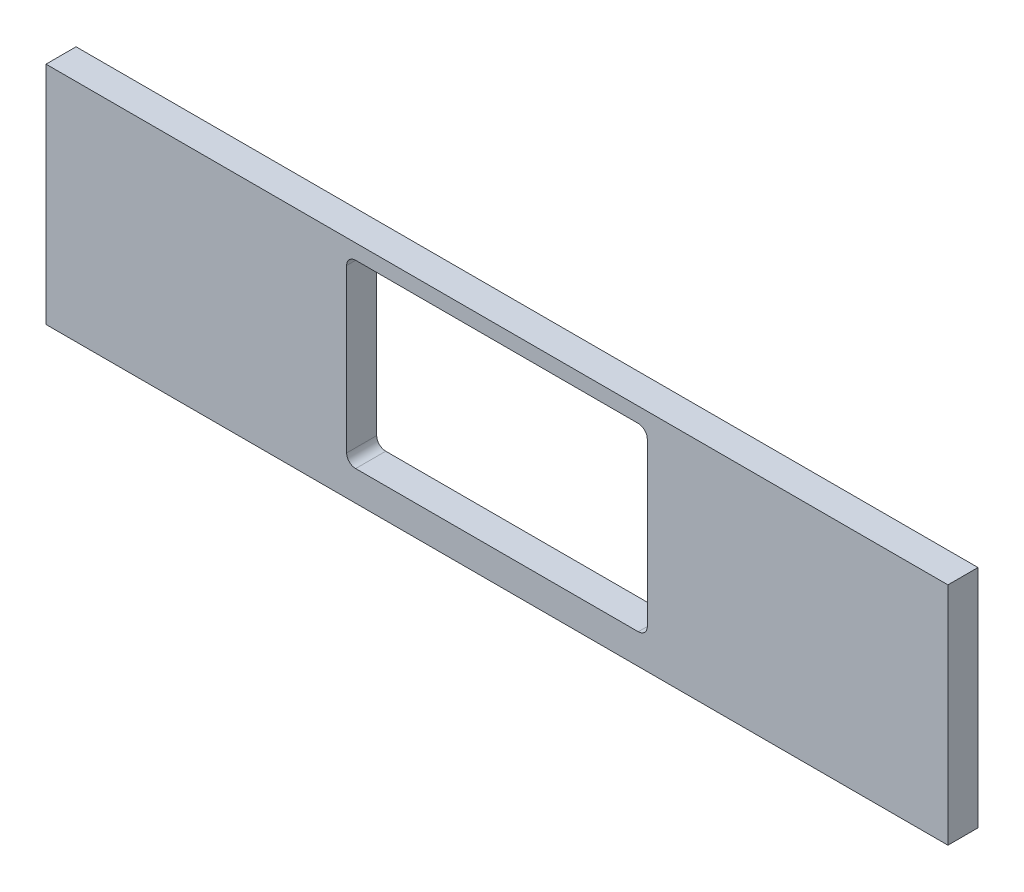
ISO-10303-21;
HEADER;
FILE_DESCRIPTION(('STEP AP214'),'2;1');
FILE_NAME('part.step','',(''),(''),'','','');
FILE_SCHEMA(('AUTOMOTIVE_DESIGN { 1 0 10303 214 1 1 1 1 }'));
ENDSEC;
DATA;
#1=APPLICATION_CONTEXT('core data for automotive mechanical design processes');
#2=APPLICATION_PROTOCOL_DEFINITION('international standard','automotive_design',2000,#1);
#3=PRODUCT_CONTEXT('',#1,'mechanical');
#4=PRODUCT('Part','Part','',(#3));
#5=PRODUCT_RELATED_PRODUCT_CATEGORY('part','',(#4));
#6=PRODUCT_DEFINITION_FORMATION('','',#4);
#7=PRODUCT_DEFINITION_CONTEXT('part definition',#1,'design');
#8=PRODUCT_DEFINITION('design','',#6,#7);
#9=PRODUCT_DEFINITION_SHAPE('','',#8);
#10=(LENGTH_UNIT() NAMED_UNIT(*) SI_UNIT(.MILLI.,.METRE.));
#11=(NAMED_UNIT(*) PLANE_ANGLE_UNIT() SI_UNIT($,.RADIAN.));
#12=(NAMED_UNIT(*) SI_UNIT($,.STERADIAN.) SOLID_ANGLE_UNIT());
#13=UNCERTAINTY_MEASURE_WITH_UNIT(LENGTH_MEASURE(1.E-05),#10,'distance_accuracy_value','');
#14=(GEOMETRIC_REPRESENTATION_CONTEXT(3) GLOBAL_UNCERTAINTY_ASSIGNED_CONTEXT((#13)) GLOBAL_UNIT_ASSIGNED_CONTEXT((#10,
#11,#12)) REPRESENTATION_CONTEXT('',''));
#15=CARTESIAN_POINT('',(0.,0.,0.));
#16=DIRECTION('',(0.,0.,1.));
#17=DIRECTION('',(1.,0.,0.));
#18=AXIS2_PLACEMENT_3D('',#15,#16,#17);
#19=CARTESIAN_POINT('',(150.,-150.,10.));
#20=DIRECTION('',(-1.,0.,0.));
#21=DIRECTION('',(0.,0.,1.));
#22=AXIS2_PLACEMENT_3D('',#19,#20,#21);
#23=PLANE('',#22);
#24=DIRECTION('',(0.,1.,0.));
#25=VECTOR('',#24,1.);
#26=CARTESIAN_POINT('',(150.,-150.,0.));
#27=LINE('',#26,#25);
#28=CARTESIAN_POINT('',(150.,-150.,0.));
#29=VERTEX_POINT('',#28);
#30=CARTESIAN_POINT('',(150.,-75.,0.));
#31=VERTEX_POINT('',#30);
#32=EDGE_CURVE('E143',#29,#31,#27,.T.);
#33=ORIENTED_EDGE('',*,*,#32,.T.);
#34=DIRECTION('',(0.,0.,-1.));
#35=VECTOR('',#34,1.);
#36=CARTESIAN_POINT('',(150.,-75.,10.));
#37=LINE('',#36,#35);
#38=CARTESIAN_POINT('',(150.,-75.,10.));
#39=VERTEX_POINT('',#38);
#40=EDGE_CURVE('E124',#39,#31,#37,.T.);
#41=ORIENTED_EDGE('',*,*,#40,.F.);
#42=DIRECTION('',(0.,1.,0.));
#43=VECTOR('',#42,1.);
#44=CARTESIAN_POINT('',(150.,-150.,10.));
#45=LINE('',#44,#43);
#46=CARTESIAN_POINT('',(150.,-150.,10.));
#47=VERTEX_POINT('',#46);
#48=EDGE_CURVE('E131',#47,#39,#45,.T.);
#49=ORIENTED_EDGE('',*,*,#48,.F.);
#50=DIRECTION('',(0.,0.,-1.));
#51=VECTOR('',#50,1.);
#52=CARTESIAN_POINT('',(150.,-150.,10.));
#53=LINE('',#52,#51);
#54=EDGE_CURVE('E215',#47,#29,#53,.T.);
#55=ORIENTED_EDGE('',*,*,#54,.T.);
#56=EDGE_LOOP('',(#33,#41,#49,#55));
#57=FACE_BOUND('',#56,.T.);
#58=ADVANCED_FACE('F31',(#57),#23,.F.);
#59=CARTESIAN_POINT('',(150.,-75.,10.));
#60=DIRECTION('',(0.,-1.,0.));
#61=DIRECTION('',(1.,0.,0.));
#62=AXIS2_PLACEMENT_3D('',#59,#60,#61);
#63=PLANE('',#62);
#64=DIRECTION('',(-1.,0.,0.));
#65=VECTOR('',#64,1.);
#66=CARTESIAN_POINT('',(150.,-75.,0.));
#67=LINE('',#66,#65);
#68=CARTESIAN_POINT('',(-150.,-75.,0.));
#69=VERTEX_POINT('',#68);
#70=EDGE_CURVE('E217',#31,#69,#67,.T.);
#71=ORIENTED_EDGE('',*,*,#70,.T.);
#72=DIRECTION('',(0.,0.,-1.));
#73=VECTOR('',#72,1.);
#74=CARTESIAN_POINT('',(-150.,-75.,10.));
#75=LINE('',#74,#73);
#76=CARTESIAN_POINT('',(-150.,-75.,10.));
#77=VERTEX_POINT('',#76);
#78=EDGE_CURVE('E127',#77,#69,#75,.T.);
#79=ORIENTED_EDGE('',*,*,#78,.F.);
#80=DIRECTION('',(-1.,0.,0.));
#81=VECTOR('',#80,1.);
#82=CARTESIAN_POINT('',(150.,-75.,10.));
#83=LINE('',#82,#81);
#84=EDGE_CURVE('E120',#39,#77,#83,.T.);
#85=ORIENTED_EDGE('',*,*,#84,.F.);
#86=ORIENTED_EDGE('',*,*,#40,.T.);
#87=EDGE_LOOP('',(#71,#79,#85,#86));
#88=FACE_BOUND('',#87,.T.);
#89=ADVANCED_FACE('F122',(#88),#63,.F.);
#90=CARTESIAN_POINT('',(-150.,-150.,10.));
#91=DIRECTION('',(1.,0.,0.));
#92=DIRECTION('',(0.,0.,-1.));
#93=AXIS2_PLACEMENT_3D('',#90,#91,#92);
#94=PLANE('',#93);
#95=DIRECTION('',(0.,-1.,0.));
#96=VECTOR('',#95,1.);
#97=CARTESIAN_POINT('',(-150.,-150.,0.));
#98=LINE('',#97,#96);
#99=CARTESIAN_POINT('',(-150.,-150.,0.));
#100=VERTEX_POINT('',#99);
#101=EDGE_CURVE('E219',#69,#100,#98,.T.);
#102=ORIENTED_EDGE('',*,*,#101,.T.);
#103=DIRECTION('',(0.,0.,-1.));
#104=VECTOR('',#103,1.);
#105=CARTESIAN_POINT('',(-150.,-150.,10.));
#106=LINE('',#105,#104);
#107=CARTESIAN_POINT('',(-150.,-150.,10.));
#108=VERTEX_POINT('',#107);
#109=EDGE_CURVE('E148',#108,#100,#106,.T.);
#110=ORIENTED_EDGE('',*,*,#109,.F.);
#111=DIRECTION('',(0.,-1.,0.));
#112=VECTOR('',#111,1.);
#113=CARTESIAN_POINT('',(-150.,-150.,10.));
#114=LINE('',#113,#112);
#115=EDGE_CURVE('E130',#77,#108,#114,.T.);
#116=ORIENTED_EDGE('',*,*,#115,.F.);
#117=ORIENTED_EDGE('',*,*,#78,.T.);
#118=EDGE_LOOP('',(#102,#110,#116,#117));
#119=FACE_BOUND('',#118,.T.);
#120=ADVANCED_FACE('F231',(#119),#94,.F.);
#121=CARTESIAN_POINT('',(150.,-150.,10.));
#122=DIRECTION('',(0.,1.,0.));
#123=DIRECTION('',(-1.,0.,0.));
#124=AXIS2_PLACEMENT_3D('',#121,#122,#123);
#125=PLANE('',#124);
#126=DIRECTION('',(1.,0.,0.));
#127=VECTOR('',#126,1.);
#128=CARTESIAN_POINT('',(150.,-150.,0.));
#129=LINE('',#128,#127);
#130=EDGE_CURVE('E140',#100,#29,#129,.T.);
#131=ORIENTED_EDGE('',*,*,#130,.T.);
#132=ORIENTED_EDGE('',*,*,#54,.F.);
#133=DIRECTION('',(1.,0.,0.));
#134=VECTOR('',#133,1.);
#135=CARTESIAN_POINT('',(150.,-150.,10.));
#136=LINE('',#135,#134);
#137=EDGE_CURVE('E136',#108,#47,#136,.T.);
#138=ORIENTED_EDGE('',*,*,#137,.F.);
#139=ORIENTED_EDGE('',*,*,#109,.T.);
#140=EDGE_LOOP('',(#131,#132,#138,#139));
#141=FACE_BOUND('',#140,.T.);
#142=ADVANCED_FACE('F226',(#141),#125,.F.);
#143=CARTESIAN_POINT('',(150.,-75.,10.));
#144=DIRECTION('',(0.,0.,1.));
#145=DIRECTION('',(1.,0.,0.));
#146=AXIS2_PLACEMENT_3D('',#143,#144,#145);
#147=PLANE('',#146);
#148=DIRECTION('',(0.,1.,0.));
#149=VECTOR('',#148,1.);
#150=CARTESIAN_POINT('',(50.,-140.,10.));
#151=LINE('',#150,#149);
#152=CARTESIAN_POINT('',(50.,-137.,10.));
#153=VERTEX_POINT('',#152);
#154=CARTESIAN_POINT('',(50.,-83.,10.));
#155=VERTEX_POINT('',#154);
#156=EDGE_CURVE('E183',#153,#155,#151,.T.);
#157=ORIENTED_EDGE('',*,*,#156,.F.);
#158=CARTESIAN_POINT('',(47.,-137.,10.));
#159=DIRECTION('',(0.,0.,1.));
#160=DIRECTION('',(1.,0.,0.));
#161=AXIS2_PLACEMENT_3D('',#158,#159,#160);
#162=CIRCLE('',#161,3.);
#163=CARTESIAN_POINT('',(47.,-140.,10.));
#164=VERTEX_POINT('',#163);
#165=EDGE_CURVE('E172',#153,#164,#162,.F.);
#166=ORIENTED_EDGE('',*,*,#165,.T.);
#167=DIRECTION('',(1.,0.,0.));
#168=VECTOR('',#167,1.);
#169=CARTESIAN_POINT('',(50.,-140.,10.));
#170=LINE('',#169,#168);
#171=CARTESIAN_POINT('',(-47.,-140.,10.));
#172=VERTEX_POINT('',#171);
#173=EDGE_CURVE('E202',#172,#164,#170,.T.);
#174=ORIENTED_EDGE('',*,*,#173,.F.);
#175=CARTESIAN_POINT('',(-47.,-137.,10.));
#176=DIRECTION('',(0.,0.,1.));
#177=DIRECTION('',(1.,0.,0.));
#178=AXIS2_PLACEMENT_3D('',#175,#176,#177);
#179=CIRCLE('',#178,3.);
#180=CARTESIAN_POINT('',(-50.,-137.,10.));
#181=VERTEX_POINT('',#180);
#182=EDGE_CURVE('E168',#172,#181,#179,.F.);
#183=ORIENTED_EDGE('',*,*,#182,.T.);
#184=DIRECTION('',(0.,-1.,0.));
#185=VECTOR('',#184,1.);
#186=CARTESIAN_POINT('',(-50.,-140.,10.));
#187=LINE('',#186,#185);
#188=CARTESIAN_POINT('',(-50.,-83.,10.));
#189=VERTEX_POINT('',#188);
#190=EDGE_CURVE('E208',#189,#181,#187,.T.);
#191=ORIENTED_EDGE('',*,*,#190,.F.);
#192=CARTESIAN_POINT('',(-47.,-83.,10.));
#193=DIRECTION('',(0.,0.,1.));
#194=DIRECTION('',(1.,0.,0.));
#195=AXIS2_PLACEMENT_3D('',#192,#193,#194);
#196=CIRCLE('',#195,3.);
#197=CARTESIAN_POINT('',(-47.,-80.,10.));
#198=VERTEX_POINT('',#197);
#199=EDGE_CURVE('E176',#189,#198,#196,.F.);
#200=ORIENTED_EDGE('',*,*,#199,.T.);
#201=DIRECTION('',(-1.,0.,0.));
#202=VECTOR('',#201,1.);
#203=CARTESIAN_POINT('',(50.,-80.,10.));
#204=LINE('',#203,#202);
#205=CARTESIAN_POINT('',(47.,-80.,10.));
#206=VERTEX_POINT('',#205);
#207=EDGE_CURVE('E184',#206,#198,#204,.T.);
#208=ORIENTED_EDGE('',*,*,#207,.F.);
#209=CARTESIAN_POINT('',(47.,-83.,10.));
#210=DIRECTION('',(0.,0.,1.));
#211=DIRECTION('',(1.,0.,0.));
#212=AXIS2_PLACEMENT_3D('',#209,#210,#211);
#213=CIRCLE('',#212,3.);
#214=EDGE_CURVE('E39',#206,#155,#213,.F.);
#215=ORIENTED_EDGE('',*,*,#214,.T.);
#216=EDGE_LOOP('',(#157,#166,#174,#183,#191,#200,#208,#215));
#217=FACE_BOUND('',#216,.T.);
#218=ORIENTED_EDGE('',*,*,#48,.T.);
#219=ORIENTED_EDGE('',*,*,#84,.T.);
#220=ORIENTED_EDGE('',*,*,#115,.T.);
#221=ORIENTED_EDGE('',*,*,#137,.T.);
#222=EDGE_LOOP('',(#218,#219,#220,#221));
#223=FACE_BOUND('',#222,.T.);
#224=ADVANCED_FACE('F134',(#217,#223),#147,.T.);
#225=CARTESIAN_POINT('',(150.,-75.,0.));
#226=DIRECTION('',(0.,0.,1.));
#227=DIRECTION('',(1.,0.,0.));
#228=AXIS2_PLACEMENT_3D('',#225,#226,#227);
#229=PLANE('',#228);
#230=DIRECTION('',(0.,-1.,0.));
#231=VECTOR('',#230,1.);
#232=CARTESIAN_POINT('',(-50.,-140.,0.));
#233=LINE('',#232,#231);
#234=CARTESIAN_POINT('',(-50.,-83.,0.));
#235=VERTEX_POINT('',#234);
#236=CARTESIAN_POINT('',(-50.,-137.,0.));
#237=VERTEX_POINT('',#236);
#238=EDGE_CURVE('E196',#235,#237,#233,.T.);
#239=ORIENTED_EDGE('',*,*,#238,.T.);
#240=CARTESIAN_POINT('',(-47.,-137.,0.));
#241=DIRECTION('',(0.,0.,1.));
#242=DIRECTION('',(1.,0.,0.));
#243=AXIS2_PLACEMENT_3D('',#240,#241,#242);
#244=CIRCLE('',#243,3.);
#245=CARTESIAN_POINT('',(-47.,-140.,0.));
#246=VERTEX_POINT('',#245);
#247=EDGE_CURVE('E170',#237,#246,#244,.T.);
#248=ORIENTED_EDGE('',*,*,#247,.T.);
#249=DIRECTION('',(1.,0.,0.));
#250=VECTOR('',#249,1.);
#251=CARTESIAN_POINT('',(50.,-140.,0.));
#252=LINE('',#251,#250);
#253=CARTESIAN_POINT('',(47.,-140.,0.));
#254=VERTEX_POINT('',#253);
#255=EDGE_CURVE('E200',#246,#254,#252,.T.);
#256=ORIENTED_EDGE('',*,*,#255,.T.);
#257=CARTESIAN_POINT('',(47.,-137.,0.));
#258=DIRECTION('',(0.,0.,1.));
#259=DIRECTION('',(1.,0.,0.));
#260=AXIS2_PLACEMENT_3D('',#257,#258,#259);
#261=CIRCLE('',#260,3.);
#262=CARTESIAN_POINT('',(50.,-137.,0.));
#263=VERTEX_POINT('',#262);
#264=EDGE_CURVE('E174',#254,#263,#261,.T.);
#265=ORIENTED_EDGE('',*,*,#264,.T.);
#266=DIRECTION('',(0.,1.,0.));
#267=VECTOR('',#266,1.);
#268=CARTESIAN_POINT('',(50.,-140.,0.));
#269=LINE('',#268,#267);
#270=CARTESIAN_POINT('',(50.,-83.,0.));
#271=VERTEX_POINT('',#270);
#272=EDGE_CURVE('E197',#263,#271,#269,.T.);
#273=ORIENTED_EDGE('',*,*,#272,.T.);
#274=CARTESIAN_POINT('',(47.,-83.,0.));
#275=DIRECTION('',(0.,0.,1.));
#276=DIRECTION('',(1.,0.,0.));
#277=AXIS2_PLACEMENT_3D('',#274,#275,#276);
#278=CIRCLE('',#277,3.);
#279=CARTESIAN_POINT('',(47.,-80.,0.));
#280=VERTEX_POINT('',#279);
#281=EDGE_CURVE('E11',#271,#280,#278,.T.);
#282=ORIENTED_EDGE('',*,*,#281,.T.);
#283=DIRECTION('',(-1.,0.,0.));
#284=VECTOR('',#283,1.);
#285=CARTESIAN_POINT('',(50.,-80.,0.));
#286=LINE('',#285,#284);
#287=CARTESIAN_POINT('',(-47.,-80.,0.));
#288=VERTEX_POINT('',#287);
#289=EDGE_CURVE('E194',#280,#288,#286,.T.);
#290=ORIENTED_EDGE('',*,*,#289,.T.);
#291=CARTESIAN_POINT('',(-47.,-83.,0.));
#292=DIRECTION('',(0.,0.,1.));
#293=DIRECTION('',(1.,0.,0.));
#294=AXIS2_PLACEMENT_3D('',#291,#292,#293);
#295=CIRCLE('',#294,3.);
#296=EDGE_CURVE('E178',#288,#235,#295,.T.);
#297=ORIENTED_EDGE('',*,*,#296,.T.);
#298=EDGE_LOOP('',(#239,#248,#256,#265,#273,#282,#290,#297));
#299=FACE_BOUND('',#298,.T.);
#300=ORIENTED_EDGE('',*,*,#32,.F.);
#301=ORIENTED_EDGE('',*,*,#130,.F.);
#302=ORIENTED_EDGE('',*,*,#101,.F.);
#303=ORIENTED_EDGE('',*,*,#70,.F.);
#304=EDGE_LOOP('',(#300,#301,#302,#303));
#305=FACE_BOUND('',#304,.T.);
#306=ADVANCED_FACE('F230',(#299,#305),#229,.F.);
#307=CARTESIAN_POINT('',(50.,-140.,0.));
#308=DIRECTION('',(1.,0.,0.));
#309=DIRECTION('',(0.,0.,-1.));
#310=AXIS2_PLACEMENT_3D('',#307,#308,#309);
#311=PLANE('',#310);
#312=ORIENTED_EDGE('',*,*,#272,.F.);
#313=DIRECTION('',(0.,0.,1.));
#314=VECTOR('',#313,1.);
#315=CARTESIAN_POINT('',(50.,-137.,10.));
#316=LINE('',#315,#314);
#317=EDGE_CURVE('E161',#263,#153,#316,.T.);
#318=ORIENTED_EDGE('',*,*,#317,.T.);
#319=ORIENTED_EDGE('',*,*,#156,.T.);
#320=DIRECTION('',(0.,0.,1.));
#321=VECTOR('',#320,1.);
#322=CARTESIAN_POINT('',(50.,-83.,0.));
#323=LINE('',#322,#321);
#324=EDGE_CURVE('E159',#155,#271,#323,.F.);
#325=ORIENTED_EDGE('',*,*,#324,.T.);
#326=EDGE_LOOP('',(#312,#318,#319,#325));
#327=FACE_BOUND('',#326,.T.);
#328=ADVANCED_FACE('F190',(#327),#311,.F.);
#329=CARTESIAN_POINT('',(50.,-140.,0.));
#330=DIRECTION('',(0.,-1.,0.));
#331=DIRECTION('',(0.,0.,-1.));
#332=AXIS2_PLACEMENT_3D('',#329,#330,#331);
#333=PLANE('',#332);
#334=ORIENTED_EDGE('',*,*,#255,.F.);
#335=DIRECTION('',(0.,0.,1.));
#336=VECTOR('',#335,1.);
#337=CARTESIAN_POINT('',(-47.,-140.,10.));
#338=LINE('',#337,#336);
#339=EDGE_CURVE('E146',#246,#172,#338,.T.);
#340=ORIENTED_EDGE('',*,*,#339,.T.);
#341=ORIENTED_EDGE('',*,*,#173,.T.);
#342=DIRECTION('',(0.,0.,1.));
#343=VECTOR('',#342,1.);
#344=CARTESIAN_POINT('',(47.,-140.,0.));
#345=LINE('',#344,#343);
#346=EDGE_CURVE('E144',#164,#254,#345,.F.);
#347=ORIENTED_EDGE('',*,*,#346,.T.);
#348=EDGE_LOOP('',(#334,#340,#341,#347));
#349=FACE_BOUND('',#348,.T.);
#350=ADVANCED_FACE('F269',(#349),#333,.F.);
#351=CARTESIAN_POINT('',(-50.,-140.,0.));
#352=DIRECTION('',(-1.,0.,0.));
#353=DIRECTION('',(0.,0.,1.));
#354=AXIS2_PLACEMENT_3D('',#351,#352,#353);
#355=PLANE('',#354);
#356=ORIENTED_EDGE('',*,*,#190,.T.);
#357=DIRECTION('',(0.,0.,1.));
#358=VECTOR('',#357,1.);
#359=CARTESIAN_POINT('',(-50.,-137.,0.));
#360=LINE('',#359,#358);
#361=EDGE_CURVE('E157',#181,#237,#360,.F.);
#362=ORIENTED_EDGE('',*,*,#361,.T.);
#363=ORIENTED_EDGE('',*,*,#238,.F.);
#364=DIRECTION('',(0.,0.,1.));
#365=VECTOR('',#364,1.);
#366=CARTESIAN_POINT('',(-50.,-83.,10.));
#367=LINE('',#366,#365);
#368=EDGE_CURVE('E154',#235,#189,#367,.T.);
#369=ORIENTED_EDGE('',*,*,#368,.T.);
#370=EDGE_LOOP('',(#356,#362,#363,#369));
#371=FACE_BOUND('',#370,.T.);
#372=ADVANCED_FACE('F262',(#371),#355,.F.);
#373=CARTESIAN_POINT('',(50.,-80.,0.));
#374=DIRECTION('',(0.,1.,0.));
#375=DIRECTION('',(-1.,0.,0.));
#376=AXIS2_PLACEMENT_3D('',#373,#374,#375);
#377=PLANE('',#376);
#378=ORIENTED_EDGE('',*,*,#207,.T.);
#379=DIRECTION('',(0.,0.,1.));
#380=VECTOR('',#379,1.);
#381=CARTESIAN_POINT('',(-47.,-80.,0.));
#382=LINE('',#381,#380);
#383=EDGE_CURVE('E46',#198,#288,#382,.F.);
#384=ORIENTED_EDGE('',*,*,#383,.T.);
#385=ORIENTED_EDGE('',*,*,#289,.F.);
#386=DIRECTION('',(0.,0.,1.));
#387=VECTOR('',#386,1.);
#388=CARTESIAN_POINT('',(47.,-80.,10.));
#389=LINE('',#388,#387);
#390=EDGE_CURVE('E164',#280,#206,#389,.T.);
#391=ORIENTED_EDGE('',*,*,#390,.T.);
#392=EDGE_LOOP('',(#378,#384,#385,#391));
#393=FACE_BOUND('',#392,.T.);
#394=ADVANCED_FACE('F193',(#393),#377,.F.);
#395=CARTESIAN_POINT('',(-47.,-137.,0.));
#396=DIRECTION('',(0.,0.,-1.));
#397=DIRECTION('',(-1.,0.,0.));
#398=AXIS2_PLACEMENT_3D('',#395,#396,#397);
#399=CYLINDRICAL_SURFACE('',#398,3.);
#400=ORIENTED_EDGE('',*,*,#247,.F.);
#401=ORIENTED_EDGE('',*,*,#361,.F.);
#402=ORIENTED_EDGE('',*,*,#182,.F.);
#403=ORIENTED_EDGE('',*,*,#339,.F.);
#404=EDGE_LOOP('',(#400,#401,#402,#403));
#405=FACE_BOUND('',#404,.T.);
#406=ADVANCED_FACE('F245',(#405),#399,.F.);
#407=CARTESIAN_POINT('',(47.,-137.,0.));
#408=DIRECTION('',(0.,0.,-1.));
#409=DIRECTION('',(-1.,0.,0.));
#410=AXIS2_PLACEMENT_3D('',#407,#408,#409);
#411=CYLINDRICAL_SURFACE('',#410,3.);
#412=ORIENTED_EDGE('',*,*,#264,.F.);
#413=ORIENTED_EDGE('',*,*,#346,.F.);
#414=ORIENTED_EDGE('',*,*,#165,.F.);
#415=ORIENTED_EDGE('',*,*,#317,.F.);
#416=EDGE_LOOP('',(#412,#413,#414,#415));
#417=FACE_BOUND('',#416,.T.);
#418=ADVANCED_FACE('F248',(#417),#411,.F.);
#419=CARTESIAN_POINT('',(-47.,-83.,0.));
#420=DIRECTION('',(0.,0.,-1.));
#421=DIRECTION('',(-1.,0.,0.));
#422=AXIS2_PLACEMENT_3D('',#419,#420,#421);
#423=CYLINDRICAL_SURFACE('',#422,3.);
#424=ORIENTED_EDGE('',*,*,#296,.F.);
#425=ORIENTED_EDGE('',*,*,#383,.F.);
#426=ORIENTED_EDGE('',*,*,#199,.F.);
#427=ORIENTED_EDGE('',*,*,#368,.F.);
#428=EDGE_LOOP('',(#424,#425,#426,#427));
#429=FACE_BOUND('',#428,.T.);
#430=ADVANCED_FACE('F251',(#429),#423,.F.);
#431=CARTESIAN_POINT('',(47.,-83.,0.));
#432=DIRECTION('',(0.,0.,-1.));
#433=DIRECTION('',(-1.,0.,0.));
#434=AXIS2_PLACEMENT_3D('',#431,#432,#433);
#435=CYLINDRICAL_SURFACE('',#434,3.);
#436=ORIENTED_EDGE('',*,*,#281,.F.);
#437=ORIENTED_EDGE('',*,*,#324,.F.);
#438=ORIENTED_EDGE('',*,*,#214,.F.);
#439=ORIENTED_EDGE('',*,*,#390,.F.);
#440=EDGE_LOOP('',(#436,#437,#438,#439));
#441=FACE_BOUND('',#440,.T.);
#442=ADVANCED_FACE('F33',(#441),#435,.F.);
#443=CLOSED_SHELL('',(#58,#89,#120,#142,#224,#306,#328,#350,#372,#394,#406,#418,#430,#442));
#444=MANIFOLD_SOLID_BREP('B2',#443);
#445=ADVANCED_BREP_SHAPE_REPRESENTATION('',(#18,#444),#14);
#446=SHAPE_DEFINITION_REPRESENTATION(#9,#445);
ENDSEC;
END-ISO-10303-21;
